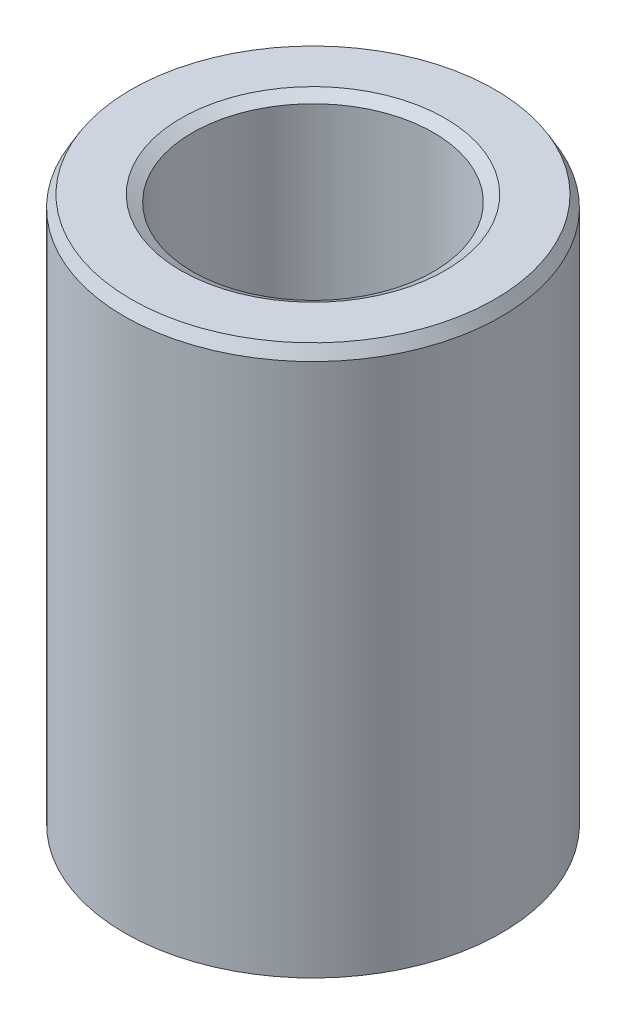
ISO-10303-21;
HEADER;
FILE_DESCRIPTION(('STEP AP214'),'2;1');
FILE_NAME('part.step','',(''),(''),'','','');
FILE_SCHEMA(('AUTOMOTIVE_DESIGN { 1 0 10303 214 1 1 1 1 }'));
ENDSEC;
DATA;
#1=APPLICATION_CONTEXT('core data for automotive mechanical design processes');
#2=APPLICATION_PROTOCOL_DEFINITION('international standard','automotive_design',2000,#1);
#3=PRODUCT_CONTEXT('',#1,'mechanical');
#4=PRODUCT('Part','Part','',(#3));
#5=PRODUCT_RELATED_PRODUCT_CATEGORY('part','',(#4));
#6=PRODUCT_DEFINITION_FORMATION('','',#4);
#7=PRODUCT_DEFINITION_CONTEXT('part definition',#1,'design');
#8=PRODUCT_DEFINITION('design','',#6,#7);
#9=PRODUCT_DEFINITION_SHAPE('','',#8);
#10=(LENGTH_UNIT() NAMED_UNIT(*) SI_UNIT(.MILLI.,.METRE.));
#11=(NAMED_UNIT(*) PLANE_ANGLE_UNIT() SI_UNIT($,.RADIAN.));
#12=(NAMED_UNIT(*) SI_UNIT($,.STERADIAN.) SOLID_ANGLE_UNIT());
#13=UNCERTAINTY_MEASURE_WITH_UNIT(LENGTH_MEASURE(1.E-05),#10,'distance_accuracy_value','');
#14=(GEOMETRIC_REPRESENTATION_CONTEXT(3) GLOBAL_UNCERTAINTY_ASSIGNED_CONTEXT((#13)) GLOBAL_UNIT_ASSIGNED_CONTEXT((#10,
#11,#12)) REPRESENTATION_CONTEXT('',''));
#15=CARTESIAN_POINT('',(0.,0.,0.));
#16=DIRECTION('',(0.,0.,1.));
#17=DIRECTION('',(1.,0.,0.));
#18=AXIS2_PLACEMENT_3D('',#15,#16,#17);
#19=CARTESIAN_POINT('',(0.,124.511362411654,0.));
#20=DIRECTION('',(0.,-1.,0.));
#21=DIRECTION('',(0.,0.,-1.));
#22=AXIS2_PLACEMENT_3D('',#19,#20,#21);
#23=CYLINDRICAL_SURFACE('',#22,42.5);
#24=CARTESIAN_POINT('',(0.,1.50129118355619,0.));
#25=DIRECTION('',(0.,1.,0.));
#26=DIRECTION('',(0.,0.,1.));
#27=AXIS2_PLACEMENT_3D('',#24,#25,#26);
#28=CIRCLE('',#27,42.5);
#29=CARTESIAN_POINT('',(0.,1.50129118355619,42.5));
#30=VERTEX_POINT('',#29);
#31=EDGE_CURVE('E10',#30,#30,#28,.T.);
#32=ORIENTED_EDGE('',*,*,#31,.T.);
#33=EDGE_LOOP('',(#32));
#34=FACE_BOUND('',#33,.T.);
#35=CARTESIAN_POINT('',(0.,121.901982464078,0.));
#36=DIRECTION('',(0.,1.,0.));
#37=DIRECTION('',(0.,0.,1.));
#38=AXIS2_PLACEMENT_3D('',#35,#36,#37);
#39=CIRCLE('',#38,42.5);
#40=CARTESIAN_POINT('',(0.,121.901982464078,42.5));
#41=VERTEX_POINT('',#40);
#42=EDGE_CURVE('E50',#41,#41,#39,.F.);
#43=ORIENTED_EDGE('',*,*,#42,.T.);
#44=EDGE_LOOP('',(#43));
#45=FACE_BOUND('',#44,.T.);
#46=ADVANCED_FACE('F39',(#34,#45),#23,.T.);
#47=CARTESIAN_POINT('',(0.,124.511362411654,0.));
#48=DIRECTION('',(0.,1.,0.));
#49=DIRECTION('',(0.,0.,1.));
#50=AXIS2_PLACEMENT_3D('',#47,#48,#49);
#51=PLANE('',#50);
#52=CARTESIAN_POINT('',(0.,124.511362411654,0.));
#53=DIRECTION('',(0.,1.,0.));
#54=DIRECTION('',(0.,0.,1.));
#55=AXIS2_PLACEMENT_3D('',#52,#53,#54);
#56=CIRCLE('',#55,29.7828952072234);
#57=CARTESIAN_POINT('',(0.,124.511362411654,29.7828952072234));
#58=VERTEX_POINT('',#57);
#59=EDGE_CURVE('E58',#58,#58,#56,.F.);
#60=ORIENTED_EDGE('',*,*,#59,.T.);
#61=EDGE_LOOP('',(#60));
#62=FACE_BOUND('',#61,.T.);
#63=CARTESIAN_POINT('',(0.,124.511362411654,0.));
#64=DIRECTION('',(0.,1.,0.));
#65=DIRECTION('',(0.,0.,1.));
#66=AXIS2_PLACEMENT_3D('',#63,#64,#65);
#67=CIRCLE('',#66,40.9987088164439);
#68=CARTESIAN_POINT('',(0.,124.511362411654,40.9987088164439));
#69=VERTEX_POINT('',#68);
#70=EDGE_CURVE('E61',#69,#69,#67,.T.);
#71=ORIENTED_EDGE('',*,*,#70,.T.);
#72=EDGE_LOOP('',(#71));
#73=FACE_BOUND('',#72,.T.);
#74=ADVANCED_FACE('F88',(#62,#73),#51,.T.);
#75=CARTESIAN_POINT('',(0.,0.,0.));
#76=DIRECTION('',(0.,1.,0.));
#77=DIRECTION('',(0.,0.,1.));
#78=AXIS2_PLACEMENT_3D('',#75,#76,#77);
#79=PLANE('',#78);
#80=CARTESIAN_POINT('',(0.,0.,0.));
#81=DIRECTION('',(0.,1.,0.));
#82=DIRECTION('',(0.,0.,1.));
#83=AXIS2_PLACEMENT_3D('',#80,#81,#82);
#84=CIRCLE('',#83,28.6748064432038);
#85=CARTESIAN_POINT('',(0.,0.,28.6748064432038));
#86=VERTEX_POINT('',#85);
#87=EDGE_CURVE('E51',#86,#86,#84,.T.);
#88=ORIENTED_EDGE('',*,*,#87,.T.);
#89=EDGE_LOOP('',(#88));
#90=FACE_BOUND('',#89,.T.);
#91=CARTESIAN_POINT('',(0.,0.,0.));
#92=DIRECTION('',(0.,1.,0.));
#93=DIRECTION('',(0.,0.,1.));
#94=AXIS2_PLACEMENT_3D('',#91,#92,#93);
#95=CIRCLE('',#94,39.8906200524242);
#96=CARTESIAN_POINT('',(0.,0.,39.8906200524242));
#97=VERTEX_POINT('',#96);
#98=EDGE_CURVE('E54',#97,#97,#95,.F.);
#99=ORIENTED_EDGE('',*,*,#98,.T.);
#100=EDGE_LOOP('',(#99));
#101=FACE_BOUND('',#100,.T.);
#102=ADVANCED_FACE('F83',(#90,#101),#79,.F.);
#103=CARTESIAN_POINT('',(0.,124.511362411654,0.));
#104=DIRECTION('',(0.,-1.,0.));
#105=DIRECTION('',(0.,0.,-1.));
#106=AXIS2_PLACEMENT_3D('',#103,#104,#105);
#107=CYLINDRICAL_SURFACE('',#106,27.1735152596477);
#108=CARTESIAN_POINT('',(0.,123.010071228098,0.));
#109=DIRECTION('',(0.,1.,0.));
#110=DIRECTION('',(0.,0.,1.));
#111=AXIS2_PLACEMENT_3D('',#108,#109,#110);
#112=CIRCLE('',#111,27.1735152596477);
#113=CARTESIAN_POINT('',(0.,123.010071228098,27.1735152596477));
#114=VERTEX_POINT('',#113);
#115=EDGE_CURVE('E67',#114,#114,#112,.T.);
#116=ORIENTED_EDGE('',*,*,#115,.T.);
#117=EDGE_LOOP('',(#116));
#118=FACE_BOUND('',#117,.T.);
#119=CARTESIAN_POINT('',(0.,2.60937994757573,0.));
#120=DIRECTION('',(0.,1.,0.));
#121=DIRECTION('',(0.,0.,1.));
#122=AXIS2_PLACEMENT_3D('',#119,#120,#121);
#123=CIRCLE('',#122,27.1735152596477);
#124=CARTESIAN_POINT('',(0.,2.60937994757573,27.1735152596477));
#125=VERTEX_POINT('',#124);
#126=EDGE_CURVE('E69',#125,#125,#123,.F.);
#127=ORIENTED_EDGE('',*,*,#126,.T.);
#128=EDGE_LOOP('',(#127));
#129=FACE_BOUND('',#128,.T.);
#130=ADVANCED_FACE('F71',(#118,#129),#107,.F.);
#131=CARTESIAN_POINT('',(0.,123.010071228098,0.));
#132=DIRECTION('',(0.,1.,0.));
#133=DIRECTION('',(0.,0.,1.));
#134=AXIS2_PLACEMENT_3D('',#131,#132,#133);
#135=CONICAL_SURFACE('',#134,27.1735152596477,1.04870353523278);
#136=ORIENTED_EDGE('',*,*,#59,.F.);
#137=EDGE_LOOP('',(#136));
#138=FACE_BOUND('',#137,.T.);
#139=ORIENTED_EDGE('',*,*,#115,.F.);
#140=EDGE_LOOP('',(#139));
#141=FACE_BOUND('',#140,.T.);
#142=ADVANCED_FACE('F77',(#138,#141),#135,.F.);
#143=CARTESIAN_POINT('',(0.,0.,0.));
#144=DIRECTION('',(0.,-1.,0.));
#145=DIRECTION('',(0.,0.,-1.));
#146=AXIS2_PLACEMENT_3D('',#143,#144,#145);
#147=CONICAL_SURFACE('',#146,28.6748064432038,0.522092791562123);
#148=ORIENTED_EDGE('',*,*,#126,.F.);
#149=EDGE_LOOP('',(#148));
#150=FACE_BOUND('',#149,.T.);
#151=ORIENTED_EDGE('',*,*,#87,.F.);
#152=EDGE_LOOP('',(#151));
#153=FACE_BOUND('',#152,.T.);
#154=ADVANCED_FACE('F73',(#150,#153),#147,.F.);
#155=CARTESIAN_POINT('',(0.,1.50129118355619,0.));
#156=DIRECTION('',(0.,1.,0.));
#157=DIRECTION('',(0.,0.,1.));
#158=AXIS2_PLACEMENT_3D('',#155,#156,#157);
#159=CONICAL_SURFACE('',#158,42.5,1.04870353523277);
#160=ORIENTED_EDGE('',*,*,#98,.F.);
#161=EDGE_LOOP('',(#160));
#162=FACE_BOUND('',#161,.T.);
#163=ORIENTED_EDGE('',*,*,#31,.F.);
#164=EDGE_LOOP('',(#163));
#165=FACE_BOUND('',#164,.T.);
#166=ADVANCED_FACE('F76',(#162,#165),#159,.T.);
#167=CARTESIAN_POINT('',(0.,124.511362411654,0.));
#168=DIRECTION('',(0.,-1.,0.));
#169=DIRECTION('',(0.,0.,-1.));
#170=AXIS2_PLACEMENT_3D('',#167,#168,#169);
#171=CONICAL_SURFACE('',#170,40.9987088164439,0.522092791562126);
#172=ORIENTED_EDGE('',*,*,#42,.F.);
#173=EDGE_LOOP('',(#172));
#174=FACE_BOUND('',#173,.T.);
#175=ORIENTED_EDGE('',*,*,#70,.F.);
#176=EDGE_LOOP('',(#175));
#177=FACE_BOUND('',#176,.T.);
#178=ADVANCED_FACE('F45',(#174,#177),#171,.T.);
#179=CLOSED_SHELL('',(#46,#74,#102,#130,#142,#154,#166,#178));
#180=MANIFOLD_SOLID_BREP('B2',#179);
#181=ADVANCED_BREP_SHAPE_REPRESENTATION('',(#18,#180),#14);
#182=SHAPE_DEFINITION_REPRESENTATION(#9,#181);
ENDSEC;
END-ISO-10303-21;
